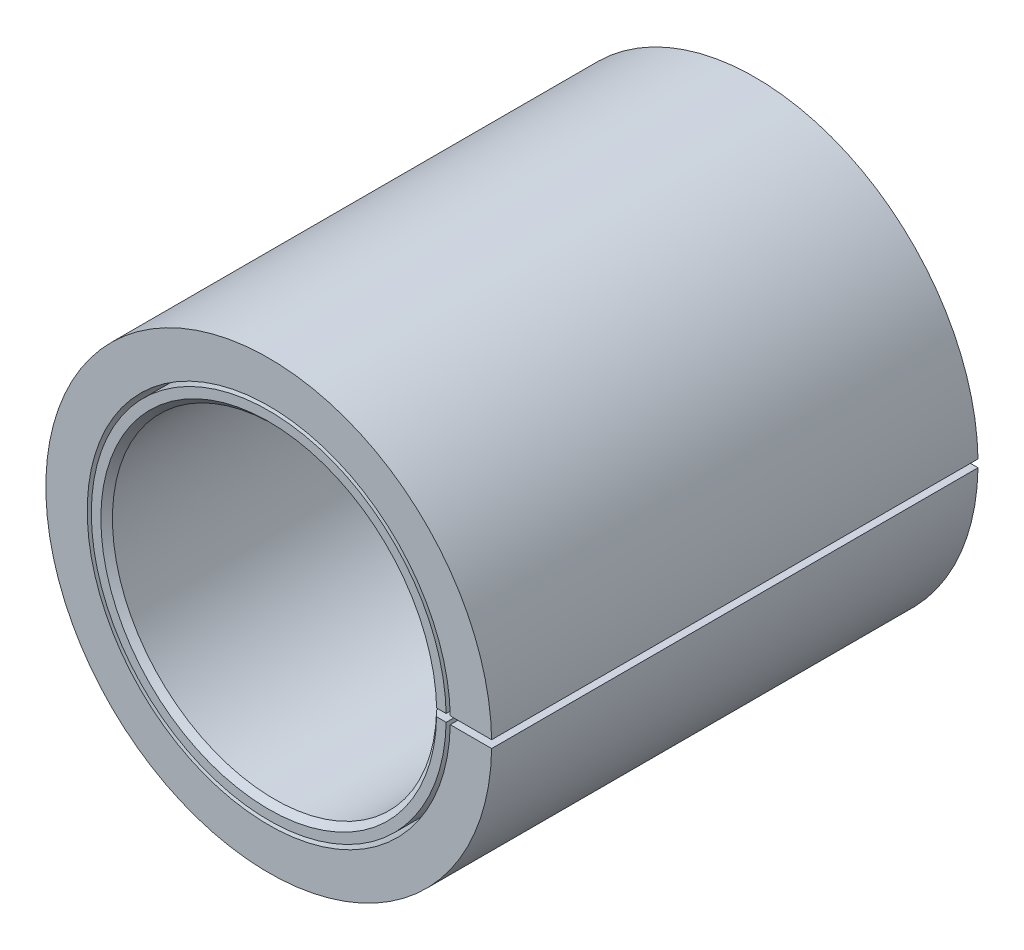
ISO-10303-21;
HEADER;
FILE_DESCRIPTION(('STEP AP214'),'2;1');
FILE_NAME('part.step','',(''),(''),'','','');
FILE_SCHEMA(('AUTOMOTIVE_DESIGN { 1 0 10303 214 1 1 1 1 }'));
ENDSEC;
DATA;
#1=APPLICATION_CONTEXT('core data for automotive mechanical design processes');
#2=APPLICATION_PROTOCOL_DEFINITION('international standard','automotive_design',2000,#1);
#3=PRODUCT_CONTEXT('',#1,'mechanical');
#4=PRODUCT('Part','Part','',(#3));
#5=PRODUCT_RELATED_PRODUCT_CATEGORY('part','',(#4));
#6=PRODUCT_DEFINITION_FORMATION('','',#4);
#7=PRODUCT_DEFINITION_CONTEXT('part definition',#1,'design');
#8=PRODUCT_DEFINITION('design','',#6,#7);
#9=PRODUCT_DEFINITION_SHAPE('','',#8);
#10=(LENGTH_UNIT() NAMED_UNIT(*) SI_UNIT(.MILLI.,.METRE.));
#11=(NAMED_UNIT(*) PLANE_ANGLE_UNIT() SI_UNIT($,.RADIAN.));
#12=(NAMED_UNIT(*) SI_UNIT($,.STERADIAN.) SOLID_ANGLE_UNIT());
#13=UNCERTAINTY_MEASURE_WITH_UNIT(LENGTH_MEASURE(1.E-05),#10,'distance_accuracy_value','');
#14=(GEOMETRIC_REPRESENTATION_CONTEXT(3) GLOBAL_UNCERTAINTY_ASSIGNED_CONTEXT((#13)) GLOBAL_UNIT_ASSIGNED_CONTEXT((#10,
#11,#12)) REPRESENTATION_CONTEXT('',''));
#15=CARTESIAN_POINT('',(0.,0.,0.));
#16=DIRECTION('',(0.,0.,1.));
#17=DIRECTION('',(1.,0.,0.));
#18=AXIS2_PLACEMENT_3D('',#15,#16,#17);
#19=CARTESIAN_POINT('',(0.,0.,3.));
#20=DIRECTION('',(0.,0.,-1.));
#21=DIRECTION('',(-1.,0.,0.));
#22=AXIS2_PLACEMENT_3D('',#19,#20,#21);
#23=CYLINDRICAL_SURFACE('',#22,2.75);
#24=CARTESIAN_POINT('',(0.,0.,-3.));
#25=DIRECTION('',(0.,0.,1.));
#26=DIRECTION('',(1.,0.,0.));
#27=AXIS2_PLACEMENT_3D('',#24,#25,#26);
#28=CIRCLE('',#27,2.75);
#29=CARTESIAN_POINT('',(2.74960046813624,0.0468750000000157,-3.));
#30=VERTEX_POINT('',#29);
#31=CARTESIAN_POINT('',(2.74960046813624,-0.0468750000000018,-3.));
#32=VERTEX_POINT('',#31);
#33=EDGE_CURVE('P0_E71',#30,#32,#28,.T.);
#34=ORIENTED_EDGE('',*,*,#33,.T.);
#35=DIRECTION('',(0.,0.,-1.));
#36=VECTOR('',#35,1.);
#37=CARTESIAN_POINT('',(2.74960046813624,-0.0468750000000018,3.));
#38=LINE('',#37,#36);
#39=CARTESIAN_POINT('',(2.74960046813624,-0.0468750000000018,3.));
#40=VERTEX_POINT('',#39);
#41=EDGE_CURVE('P0_E78',#32,#40,#38,.F.);
#42=ORIENTED_EDGE('',*,*,#41,.T.);
#43=CARTESIAN_POINT('',(0.,0.,3.));
#44=DIRECTION('',(0.,0.,1.));
#45=DIRECTION('',(1.,0.,0.));
#46=AXIS2_PLACEMENT_3D('',#43,#44,#45);
#47=CIRCLE('',#46,2.75);
#48=CARTESIAN_POINT('',(2.74960046813624,0.0468750000000226,3.));
#49=VERTEX_POINT('',#48);
#50=EDGE_CURVE('P0_E68',#49,#40,#47,.T.);
#51=ORIENTED_EDGE('',*,*,#50,.F.);
#52=DIRECTION('',(0.,0.,-1.));
#53=VECTOR('',#52,1.);
#54=CARTESIAN_POINT('',(2.74960046813624,0.0468750000000226,3.));
#55=LINE('',#54,#53);
#56=EDGE_CURVE('P0_E81',#30,#49,#55,.F.);
#57=ORIENTED_EDGE('',*,*,#56,.F.);
#58=EDGE_LOOP('',(#34,#42,#51,#57));
#59=FACE_BOUND('',#58,.T.);
#60=ADVANCED_FACE('P0_F17',(#59),#23,.T.);
#61=CARTESIAN_POINT('',(0.,0.,3.));
#62=DIRECTION('',(0.,0.,1.));
#63=DIRECTION('',(1.,0.,0.));
#64=AXIS2_PLACEMENT_3D('',#61,#62,#63);
#65=PLANE('',#64);
#66=DIRECTION('',(1.,0.,0.));
#67=VECTOR('',#66,1.);
#68=CARTESIAN_POINT('',(0.,-0.0468749999999671,3.));
#69=LINE('',#68,#67);
#70=CARTESIAN_POINT('',(2.23919513065533,-0.046874999999981,3.));
#71=VERTEX_POINT('',#70);
#72=EDGE_CURVE('P0_E56',#71,#40,#69,.T.);
#73=ORIENTED_EDGE('',*,*,#72,.F.);
#74=CARTESIAN_POINT('',(0.,0.,3.));
#75=DIRECTION('',(0.,0.,1.));
#76=DIRECTION('',(1.,0.,0.));
#77=AXIS2_PLACEMENT_3D('',#74,#75,#76);
#78=CIRCLE('',#77,2.23968571428571);
#79=CARTESIAN_POINT('',(2.23919513065533,0.0468750000000157,3.));
#80=VERTEX_POINT('',#79);
#81=EDGE_CURVE('P0_E66',#80,#71,#78,.T.);
#82=ORIENTED_EDGE('',*,*,#81,.F.);
#83=DIRECTION('',(1.,0.,0.));
#84=VECTOR('',#83,1.);
#85=CARTESIAN_POINT('',(0.,0.0468750000000018,3.));
#86=LINE('',#85,#84);
#87=EDGE_CURVE('P0_E32',#80,#49,#86,.T.);
#88=ORIENTED_EDGE('',*,*,#87,.T.);
#89=ORIENTED_EDGE('',*,*,#50,.T.);
#90=EDGE_LOOP('',(#73,#82,#88,#89));
#91=FACE_BOUND('',#90,.T.);
#92=ADVANCED_FACE('P0_F65',(#91),#65,.T.);
#93=CARTESIAN_POINT('',(0.,0.,-3.));
#94=DIRECTION('',(0.,0.,1.));
#95=DIRECTION('',(1.,0.,0.));
#96=AXIS2_PLACEMENT_3D('',#93,#94,#95);
#97=PLANE('',#96);
#98=CARTESIAN_POINT('',(0.,0.,-3.));
#99=DIRECTION('',(0.,0.,1.));
#100=DIRECTION('',(1.,0.,0.));
#101=AXIS2_PLACEMENT_3D('',#98,#99,#100);
#102=CIRCLE('',#101,2.23968571428571);
#103=CARTESIAN_POINT('',(2.23919513065533,0.0468750000000087,-3.));
#104=VERTEX_POINT('',#103);
#105=CARTESIAN_POINT('',(2.23919513065533,-0.046874999999981,-3.));
#106=VERTEX_POINT('',#105);
#107=EDGE_CURVE('P0_E74',#104,#106,#102,.T.);
#108=ORIENTED_EDGE('',*,*,#107,.T.);
#109=DIRECTION('',(1.,0.,0.));
#110=VECTOR('',#109,1.);
#111=CARTESIAN_POINT('',(0.,-0.0468749999999671,-3.));
#112=LINE('',#111,#110);
#113=EDGE_CURVE('P0_E40',#106,#32,#112,.T.);
#114=ORIENTED_EDGE('',*,*,#113,.T.);
#115=ORIENTED_EDGE('',*,*,#33,.F.);
#116=DIRECTION('',(1.,0.,0.));
#117=VECTOR('',#116,1.);
#118=CARTESIAN_POINT('',(0.,0.0468750000000018,-3.));
#119=LINE('',#118,#117);
#120=EDGE_CURVE('P0_E83',#104,#30,#119,.T.);
#121=ORIENTED_EDGE('',*,*,#120,.F.);
#122=EDGE_LOOP('',(#108,#114,#115,#121));
#123=FACE_BOUND('',#122,.T.);
#124=ADVANCED_FACE('P0_F19',(#123),#97,.F.);
#125=CARTESIAN_POINT('',(0.,0.,-3.));
#126=DIRECTION('',(0.,0.,1.));
#127=DIRECTION('',(1.,0.,0.));
#128=AXIS2_PLACEMENT_3D('',#125,#126,#127);
#129=CYLINDRICAL_SURFACE('',#128,2.23968571428571);
#130=ORIENTED_EDGE('',*,*,#81,.T.);
#131=DIRECTION('',(0.,0.,1.));
#132=VECTOR('',#131,1.);
#133=CARTESIAN_POINT('',(2.23919513065533,-0.046874999999981,-3.));
#134=LINE('',#133,#132);
#135=EDGE_CURVE('P0_E11',#71,#106,#134,.F.);
#136=ORIENTED_EDGE('',*,*,#135,.T.);
#137=ORIENTED_EDGE('',*,*,#107,.F.);
#138=DIRECTION('',(0.,0.,1.));
#139=VECTOR('',#138,1.);
#140=CARTESIAN_POINT('',(2.23919513065533,0.0468750000000087,-3.));
#141=LINE('',#140,#139);
#142=EDGE_CURVE('P0_E25',#80,#104,#141,.F.);
#143=ORIENTED_EDGE('',*,*,#142,.F.);
#144=EDGE_LOOP('',(#130,#136,#137,#143));
#145=FACE_BOUND('',#144,.T.);
#146=ADVANCED_FACE('P0_F70',(#145),#129,.F.);
#147=CARTESIAN_POINT('',(0.,0.0468750000000018,-3.));
#148=DIRECTION('',(0.,-1.,0.));
#149=DIRECTION('',(0.,0.,-1.));
#150=AXIS2_PLACEMENT_3D('',#147,#148,#149);
#151=PLANE('',#150);
#152=ORIENTED_EDGE('',*,*,#56,.T.);
#153=ORIENTED_EDGE('',*,*,#87,.F.);
#154=ORIENTED_EDGE('',*,*,#142,.T.);
#155=ORIENTED_EDGE('',*,*,#120,.T.);
#156=EDGE_LOOP('',(#152,#153,#154,#155));
#157=FACE_BOUND('',#156,.T.);
#158=ADVANCED_FACE('P0_F91',(#157),#151,.T.);
#159=CARTESIAN_POINT('',(0.,-0.0468749999999671,-3.));
#160=DIRECTION('',(0.,-1.,0.));
#161=DIRECTION('',(0.,0.,-1.));
#162=AXIS2_PLACEMENT_3D('',#159,#160,#161);
#163=PLANE('',#162);
#164=ORIENTED_EDGE('',*,*,#113,.F.);
#165=ORIENTED_EDGE('',*,*,#135,.F.);
#166=ORIENTED_EDGE('',*,*,#72,.T.);
#167=ORIENTED_EDGE('',*,*,#41,.F.);
#168=EDGE_LOOP('',(#164,#165,#166,#167));
#169=FACE_BOUND('',#168,.T.);
#170=ADVANCED_FACE('P0_F55',(#169),#163,.F.);
#171=CLOSED_SHELL('',(#60,#92,#124,#146,#158,#170));
#172=MANIFOLD_SOLID_BREP('P0_B1',#171);
#173=CARTESIAN_POINT('',(0.,0.,3.));
#174=DIRECTION('',(0.,0.,1.));
#175=DIRECTION('',(1.,0.,0.));
#176=AXIS2_PLACEMENT_3D('',#173,#174,#175);
#177=PLANE('',#176);
#178=DIRECTION('',(1.,0.,0.));
#179=VECTOR('',#178,1.);
#180=CARTESIAN_POINT('',(0.,-0.046874999999974,3.));
#181=LINE('',#180,#179);
#182=CARTESIAN_POINT('',(2.07089812905069,-0.0468749999999948,3.));
#183=VERTEX_POINT('',#182);
#184=CARTESIAN_POINT('',(2.18838374253216,-0.0468749999999948,3.));
#185=VERTEX_POINT('',#184);
#186=EDGE_CURVE('P1_E74',#183,#185,#181,.T.);
#187=ORIENTED_EDGE('',*,*,#186,.F.);
#188=CARTESIAN_POINT('',(0.,0.,3.));
#189=DIRECTION('',(0.,0.,1.));
#190=DIRECTION('',(1.,0.,0.));
#191=AXIS2_PLACEMENT_3D('',#188,#189,#190);
#192=CIRCLE('',#191,2.07142857142857);
#193=CARTESIAN_POINT('',(2.07089812905068,0.0468750000000157,3.));
#194=VERTEX_POINT('',#193);
#195=EDGE_CURVE('P1_E83',#183,#194,#192,.F.);
#196=ORIENTED_EDGE('',*,*,#195,.T.);
#197=DIRECTION('',(1.,0.,0.));
#198=VECTOR('',#197,1.);
#199=CARTESIAN_POINT('',(0.,0.0468750000000018,3.));
#200=LINE('',#199,#198);
#201=CARTESIAN_POINT('',(2.18838374253216,0.0468750000000018,3.));
#202=VERTEX_POINT('',#201);
#203=EDGE_CURVE('P1_E45',#194,#202,#200,.T.);
#204=ORIENTED_EDGE('',*,*,#203,.T.);
#205=CARTESIAN_POINT('',(0.,0.,3.));
#206=DIRECTION('',(0.,0.,1.));
#207=DIRECTION('',(1.,0.,0.));
#208=AXIS2_PLACEMENT_3D('',#205,#206,#207);
#209=CIRCLE('',#208,2.18888571428571);
#210=EDGE_CURVE('P1_E85',#202,#185,#209,.T.);
#211=ORIENTED_EDGE('',*,*,#210,.T.);
#212=EDGE_LOOP('',(#187,#196,#204,#211));
#213=FACE_BOUND('',#212,.T.);
#214=ADVANCED_FACE('P1_F17',(#213),#177,.T.);
#215=CARTESIAN_POINT('',(0.,0.,3.));
#216=DIRECTION('',(0.,0.,-1.));
#217=DIRECTION('',(-1.,0.,0.));
#218=AXIS2_PLACEMENT_3D('',#215,#216,#217);
#219=CYLINDRICAL_SURFACE('',#218,2.);
#220=DIRECTION('',(0.,0.,-1.));
#221=VECTOR('',#220,1.);
#222=CARTESIAN_POINT('',(1.9994506081359,-0.0468749999999948,3.));
#223=LINE('',#222,#221);
#224=CARTESIAN_POINT('',(1.9994506081359,-0.0468749999999948,-2.92857142857143));
#225=VERTEX_POINT('',#224);
#226=CARTESIAN_POINT('',(1.9994506081359,-0.0468749999999948,2.92857142857143));
#227=VERTEX_POINT('',#226);
#228=EDGE_CURVE('P1_E37',#225,#227,#223,.F.);
#229=ORIENTED_EDGE('',*,*,#228,.F.);
#230=CARTESIAN_POINT('',(0.,0.,-2.92857142857143));
#231=DIRECTION('',(0.,0.,1.));
#232=DIRECTION('',(1.,0.,0.));
#233=AXIS2_PLACEMENT_3D('',#230,#231,#232);
#234=CIRCLE('',#233,2.);
#235=CARTESIAN_POINT('',(1.9994506081359,0.0468750000000157,-2.92857142857143));
#236=VERTEX_POINT('',#235);
#237=EDGE_CURVE('P1_E87',#225,#236,#234,.F.);
#238=ORIENTED_EDGE('',*,*,#237,.T.);
#239=DIRECTION('',(0.,0.,-1.));
#240=VECTOR('',#239,1.);
#241=CARTESIAN_POINT('',(1.9994506081359,0.0468750000000157,3.));
#242=LINE('',#241,#240);
#243=CARTESIAN_POINT('',(1.9994506081359,0.0468750000000157,2.92857142857143));
#244=VERTEX_POINT('',#243);
#245=EDGE_CURVE('P1_E114',#236,#244,#242,.F.);
#246=ORIENTED_EDGE('',*,*,#245,.T.);
#247=CARTESIAN_POINT('',(0.,0.,2.92857142857143));
#248=DIRECTION('',(0.,0.,1.));
#249=DIRECTION('',(1.,0.,0.));
#250=AXIS2_PLACEMENT_3D('',#247,#248,#249);
#251=CIRCLE('',#250,2.);
#252=EDGE_CURVE('P1_E90',#244,#227,#251,.T.);
#253=ORIENTED_EDGE('',*,*,#252,.T.);
#254=EDGE_LOOP('',(#229,#238,#246,#253));
#255=FACE_BOUND('',#254,.T.);
#256=ADVANCED_FACE('P1_F143',(#255),#219,.F.);
#257=CARTESIAN_POINT('',(0.,0.,-3.));
#258=DIRECTION('',(0.,0.,1.));
#259=DIRECTION('',(1.,0.,0.));
#260=AXIS2_PLACEMENT_3D('',#257,#258,#259);
#261=PLANE('',#260);
#262=CARTESIAN_POINT('',(0.,0.,-3.));
#263=DIRECTION('',(0.,0.,1.));
#264=DIRECTION('',(1.,0.,0.));
#265=AXIS2_PLACEMENT_3D('',#262,#263,#264);
#266=CIRCLE('',#265,2.07142857142857);
#267=CARTESIAN_POINT('',(2.07089812905068,0.0468750000000157,-3.));
#268=VERTEX_POINT('',#267);
#269=CARTESIAN_POINT('',(2.07089812905068,-0.0468749999999948,-3.));
#270=VERTEX_POINT('',#269);
#271=EDGE_CURVE('P1_E139',#268,#270,#266,.T.);
#272=ORIENTED_EDGE('',*,*,#271,.T.);
#273=DIRECTION('',(1.,0.,0.));
#274=VECTOR('',#273,1.);
#275=CARTESIAN_POINT('',(0.,-0.046874999999974,-3.));
#276=LINE('',#275,#274);
#277=CARTESIAN_POINT('',(2.18838374253216,-0.0468749999999948,-3.));
#278=VERTEX_POINT('',#277);
#279=EDGE_CURVE('P1_E146',#270,#278,#276,.T.);
#280=ORIENTED_EDGE('',*,*,#279,.T.);
#281=CARTESIAN_POINT('',(0.,0.,-3.));
#282=DIRECTION('',(0.,0.,1.));
#283=DIRECTION('',(1.,0.,0.));
#284=AXIS2_PLACEMENT_3D('',#281,#282,#283);
#285=CIRCLE('',#284,2.18888571428571);
#286=CARTESIAN_POINT('',(2.18838374253216,0.0468750000000018,-3.));
#287=VERTEX_POINT('',#286);
#288=EDGE_CURVE('P1_E136',#287,#278,#285,.T.);
#289=ORIENTED_EDGE('',*,*,#288,.F.);
#290=DIRECTION('',(1.,0.,0.));
#291=VECTOR('',#290,1.);
#292=CARTESIAN_POINT('',(0.,0.0468750000000018,-3.));
#293=LINE('',#292,#291);
#294=EDGE_CURVE('P1_E145',#268,#287,#293,.T.);
#295=ORIENTED_EDGE('',*,*,#294,.F.);
#296=EDGE_LOOP('',(#272,#280,#289,#295));
#297=FACE_BOUND('',#296,.T.);
#298=ADVANCED_FACE('P1_F123',(#297),#261,.F.);
#299=CARTESIAN_POINT('',(0.,0.,-3.));
#300=DIRECTION('',(0.,0.,1.));
#301=DIRECTION('',(1.,0.,0.));
#302=AXIS2_PLACEMENT_3D('',#299,#300,#301);
#303=CYLINDRICAL_SURFACE('',#302,2.18888571428571);
#304=DIRECTION('',(0.,0.,1.));
#305=VECTOR('',#304,1.);
#306=CARTESIAN_POINT('',(2.18838374253216,-0.0468749999999948,-3.));
#307=LINE('',#306,#305);
#308=EDGE_CURVE('P1_E133',#185,#278,#307,.F.);
#309=ORIENTED_EDGE('',*,*,#308,.F.);
#310=ORIENTED_EDGE('',*,*,#210,.F.);
#311=DIRECTION('',(0.,0.,1.));
#312=VECTOR('',#311,1.);
#313=CARTESIAN_POINT('',(2.18838374253216,0.0468750000000018,-3.));
#314=LINE('',#313,#312);
#315=EDGE_CURVE('P1_E113',#202,#287,#314,.F.);
#316=ORIENTED_EDGE('',*,*,#315,.T.);
#317=ORIENTED_EDGE('',*,*,#288,.T.);
#318=EDGE_LOOP('',(#309,#310,#316,#317));
#319=FACE_BOUND('',#318,.T.);
#320=ADVANCED_FACE('P1_F121',(#319),#303,.T.);
#321=CARTESIAN_POINT('',(0.,0.,-3.));
#322=DIRECTION('',(0.,0.,-1.));
#323=DIRECTION('',(-1.,0.,0.));
#324=AXIS2_PLACEMENT_3D('',#321,#322,#323);
#325=CONICAL_SURFACE('',#324,2.07142857142857,0.785398163397448);
#326=CARTESIAN_POINT('',(3.51813607520002,-0.046874999999981,-4.44701976686613));
#327=CARTESIAN_POINT('',(3.25242091139846,-0.0468749999999451,-4.18133367220906));
#328=CARTESIAN_POINT('',(2.98670783767679,-0.0468749999999568,-3.91564548300981));
#329=CARTESIAN_POINT('',(2.45526910160087,-0.0468749999999916,-3.38428177828784));
#330=CARTESIAN_POINT('',(2.18954343924859,-0.0468750000000147,-3.11860626276314));
#331=CARTESIAN_POINT('',(1.79093282089891,-0.0468749999999953,-2.72011503505592));
#332=CARTESIAN_POINT('',(1.6580589050539,-0.0468749999999798,-2.58728827783686));
#333=CARTESIAN_POINT('',(1.39229603291365,-0.0468749999999684,-2.32164983948976));
#334=CARTESIAN_POINT('',(1.25940707662051,-0.0468749999999725,-2.18883815835962));
#335=CARTESIAN_POINT('',(0.993591214381114,-0.0468749999999757,-1.92325267179651));
#336=CARTESIAN_POINT('',(0.860664308416344,-0.0468749999999749,-1.79047886638209));
#337=CARTESIAN_POINT('',(0.66118993872988,-0.0468749999999737,-1.59140211568613));
#338=CARTESIAN_POINT('',(0.594684456985971,-0.0468749999999733,-1.52505716838583));
#339=CARTESIAN_POINT('',(0.461559322203215,-0.0468749999999748,-1.39248183337469));
#340=CARTESIAN_POINT('',(0.394939669048784,-0.0468749999999767,-1.32625144577996));
#341=CARTESIAN_POINT('',(0.328219905798325,-0.046874999999981,-1.26012168447128));
#342=B_SPLINE_CURVE_WITH_KNOTS('',3,(#326,#327,#328,#329,#330,#331,#332,#333,#334,#335,#336,
#337,#338,#339,#340,#341),.UNSPECIFIED.,.F.,.F.,(4,2,2,2,2,2,2,4),(0.,1.12727230760287,
2.25454443914886,2.81818069374,3.3818168697159,3.9454533211038,4.2272717449198,
4.50909045421222),.UNSPECIFIED.);
#343=EDGE_CURVE('P1_E127',#270,#225,#342,.T.);
#344=ORIENTED_EDGE('',*,*,#343,.F.);
#345=ORIENTED_EDGE('',*,*,#271,.F.);
#346=CARTESIAN_POINT('',(3.51813607520002,0.0468750000000087,-4.44701976686613));
#347=CARTESIAN_POINT('',(3.25242091139845,0.0468750000000041,-4.18133367220906));
#348=CARTESIAN_POINT('',(2.98670783767678,0.0468750000000022,-3.91564548300981));
#349=CARTESIAN_POINT('',(2.45526910160087,0.046875000000001,-3.38428177828784));
#350=CARTESIAN_POINT('',(2.18954343924859,0.0468750000000016,-3.11860626276313));
#351=CARTESIAN_POINT('',(1.79093282089891,0.0468750000000019,-2.72011503505592));
#352=CARTESIAN_POINT('',(1.6580589050539,0.0468750000000018,-2.58728827783686));
#353=CARTESIAN_POINT('',(1.39229603291365,0.0468750000000016,-2.32164983948976));
#354=CARTESIAN_POINT('',(1.25940707662051,0.0468750000000013,-2.18883815835962));
#355=CARTESIAN_POINT('',(0.993591214381114,0.0468750000000021,-1.92325267179651));
#356=CARTESIAN_POINT('',(0.860664308416343,0.0468750000000032,-1.79047886638209));
#357=CARTESIAN_POINT('',(0.661189938729878,0.046875000000001,-1.59140211568613));
#358=CARTESIAN_POINT('',(0.594684456985969,0.0468749999999996,-1.52505716838583));
#359=CARTESIAN_POINT('',(0.461559322203213,0.0468750000000039,-1.39248183337469));
#360=CARTESIAN_POINT('',(0.394939669048782,0.0468750000000094,-1.32625144577996));
#361=CARTESIAN_POINT('',(0.328219905798323,0.0468750000000226,-1.26012168447128));
#362=B_SPLINE_CURVE_WITH_KNOTS('',3,(#346,#347,#348,#349,#350,#351,#352,#353,#354,#355,#356,
#357,#358,#359,#360,#361),.UNSPECIFIED.,.F.,.F.,(4,2,2,2,2,2,2,4),(0.,1.12727230760287,
2.25454443914885,2.81818069374,3.3818168697159,3.9454533211038,4.2272717449198,
4.50909045421222),.UNSPECIFIED.);
#363=EDGE_CURVE('P1_E105',#268,#236,#362,.T.);
#364=ORIENTED_EDGE('',*,*,#363,.T.);
#365=ORIENTED_EDGE('',*,*,#237,.F.);
#366=EDGE_LOOP('',(#344,#345,#364,#365));
#367=FACE_BOUND('',#366,.T.);
#368=ADVANCED_FACE('P1_F117',(#367),#325,.F.);
#369=CARTESIAN_POINT('',(0.,0.,2.92857142857143));
#370=DIRECTION('',(0.,0.,1.));
#371=DIRECTION('',(1.,0.,0.));
#372=AXIS2_PLACEMENT_3D('',#369,#370,#371);
#373=CONICAL_SURFACE('',#372,2.,0.785398163397463);
#374=CARTESIAN_POINT('',(0.328219905798309,-0.046874999999981,1.26012168447132));
#375=CARTESIAN_POINT('',(0.3742142686215,-0.0468749999999712,1.30568180491266));
#376=CARTESIAN_POINT('',(0.420146400969388,-0.0468749999999709,1.35130454053927));
#377=CARTESIAN_POINT('',(0.511936701920357,-0.0468749999999772,1.44262429699377));
#378=CARTESIAN_POINT('',(0.557794870593584,-0.0468749999999838,1.48832131775112));
#379=CARTESIAN_POINT('',(0.787026815403997,-0.0468750000000044,1.71686453966381));
#380=CARTESIAN_POINT('',(0.970225246666726,-0.0468749999999814,1.89988644009653));
#381=CARTESIAN_POINT('',(1.33658337151023,-0.0468749999999668,2.26596927561884));
#382=CARTESIAN_POINT('',(1.51974306505419,-0.0468749999999753,2.4490302107452));
#383=CARTESIAN_POINT('',(1.77652870593937,-0.046874999999993,2.70571675094937));
#384=CARTESIAN_POINT('',(1.85016641455381,-0.0468749999999987,2.77933057918753));
#385=CARTESIAN_POINT('',(2.18954275591649,-0.0468750000000129,3.11860669135135));
#386=CARTESIAN_POINT('',(2.45526856595059,-0.0468749999999895,3.38428179862864));
#387=CARTESIAN_POINT('',(2.98670785603907,-0.0468749999999588,3.91564494545691));
#388=CARTESIAN_POINT('',(3.25242133607918,-0.0468749999999515,4.18133298502215));
#389=CARTESIAN_POINT('',(3.51813607520002,-0.0468749999999948,4.4470197668661));
#390=B_SPLINE_CURVE_WITH_KNOTS('',3,(#374,#375,#376,#377,#378,#379,#380,#381,#382,#383,#384,
#385,#386,#387,#388,#389),.UNSPECIFIED.,.F.,.F.,(4,2,2,2,2,2,2,4),(0.,0.194218309820918,
0.38843643534011,1.16530703127145,1.94217836205628,2.25454604510515,3.38181762802462,
4.50909048425397),.UNSPECIFIED.);
#391=EDGE_CURVE('P1_E11',#227,#183,#390,.T.);
#392=ORIENTED_EDGE('',*,*,#391,.F.);
#393=ORIENTED_EDGE('',*,*,#252,.F.);
#394=CARTESIAN_POINT('',(0.328219905798302,0.0468750000000087,1.26012168447132));
#395=CARTESIAN_POINT('',(0.374214268621497,0.0468750000000017,1.30568180491266));
#396=CARTESIAN_POINT('',(0.420146400969384,0.0468750000000005,1.35130454053927));
#397=CARTESIAN_POINT('',(0.511936701920347,0.046875000000003,1.44262429699376));
#398=CARTESIAN_POINT('',(0.55779487059357,0.0468750000000065,1.48832131775112));
#399=CARTESIAN_POINT('',(0.787026815403973,0.0468750000000176,1.71686453966382));
#400=CARTESIAN_POINT('',(0.970225246666716,0.0468750000000059,1.89988644009653));
#401=CARTESIAN_POINT('',(1.33658337151023,0.0468749999999976,2.26596927561884));
#402=CARTESIAN_POINT('',(1.51974306505419,0.046875000000001,2.4490302107452));
#403=CARTESIAN_POINT('',(1.77652870593937,0.0468750000000021,2.70571675094937));
#404=CARTESIAN_POINT('',(1.85016641455381,0.0468750000000019,2.77933057918753));
#405=CARTESIAN_POINT('',(2.18954275591649,0.0468750000000012,3.11860669135135));
#406=CARTESIAN_POINT('',(2.45526856595059,0.0468750000000002,3.38428179862864));
#407=CARTESIAN_POINT('',(2.98670785603907,0.046875000000003,3.91564494545691));
#408=CARTESIAN_POINT('',(3.25242133607918,0.0468750000000068,4.18133298502215));
#409=CARTESIAN_POINT('',(3.51813607520003,0.0468750000000157,4.4470197668661));
#410=B_SPLINE_CURVE_WITH_KNOTS('',3,(#394,#395,#396,#397,#398,#399,#400,#401,#402,#403,#404,
#405,#406,#407,#408,#409),.UNSPECIFIED.,.F.,.F.,(4,2,2,2,2,2,2,4),(0.,0.194218309820915,
0.388436435340103,1.16530703127145,1.94217836205629,2.25454604510515,3.38181762802463,
4.50909048425398),.UNSPECIFIED.);
#411=EDGE_CURVE('P1_E31',#244,#194,#410,.T.);
#412=ORIENTED_EDGE('',*,*,#411,.T.);
#413=ORIENTED_EDGE('',*,*,#195,.F.);
#414=EDGE_LOOP('',(#392,#393,#412,#413));
#415=FACE_BOUND('',#414,.T.);
#416=ADVANCED_FACE('P1_F19',(#415),#373,.F.);
#417=CARTESIAN_POINT('',(0.,0.0468750000000018,-3.));
#418=DIRECTION('',(0.,-1.,0.));
#419=DIRECTION('',(0.,0.,-1.));
#420=AXIS2_PLACEMENT_3D('',#417,#418,#419);
#421=PLANE('',#420);
#422=ORIENTED_EDGE('',*,*,#203,.F.);
#423=ORIENTED_EDGE('',*,*,#411,.F.);
#424=ORIENTED_EDGE('',*,*,#245,.F.);
#425=ORIENTED_EDGE('',*,*,#363,.F.);
#426=ORIENTED_EDGE('',*,*,#294,.T.);
#427=ORIENTED_EDGE('',*,*,#315,.F.);
#428=EDGE_LOOP('',(#422,#423,#424,#425,#426,#427));
#429=FACE_BOUND('',#428,.T.);
#430=ADVANCED_FACE('P1_F98',(#429),#421,.T.);
#431=CARTESIAN_POINT('',(0.,-0.046874999999974,-3.));
#432=DIRECTION('',(0.,-1.,0.));
#433=DIRECTION('',(0.,0.,-1.));
#434=AXIS2_PLACEMENT_3D('',#431,#432,#433);
#435=PLANE('',#434);
#436=ORIENTED_EDGE('',*,*,#308,.T.);
#437=ORIENTED_EDGE('',*,*,#279,.F.);
#438=ORIENTED_EDGE('',*,*,#343,.T.);
#439=ORIENTED_EDGE('',*,*,#228,.T.);
#440=ORIENTED_EDGE('',*,*,#391,.T.);
#441=ORIENTED_EDGE('',*,*,#186,.T.);
#442=EDGE_LOOP('',(#436,#437,#438,#439,#440,#441));
#443=FACE_BOUND('',#442,.T.);
#444=ADVANCED_FACE('P1_F73',(#443),#435,.F.);
#445=CLOSED_SHELL('',(#214,#256,#298,#320,#368,#416,#430,#444));
#446=MANIFOLD_SOLID_BREP('P1_B1',#445);
#447=ADVANCED_BREP_SHAPE_REPRESENTATION('',(#18,#172,#446),#14);
#448=SHAPE_DEFINITION_REPRESENTATION(#9,#447);
ENDSEC;
END-ISO-10303-21;
